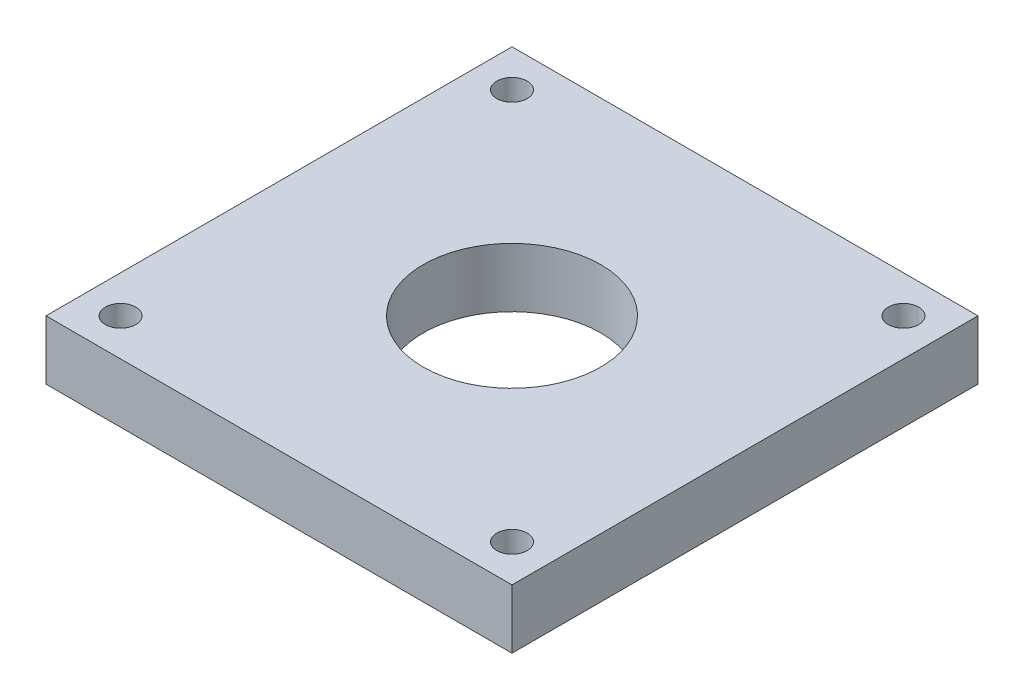
ISO-10303-21;
HEADER;
FILE_DESCRIPTION(('STEP AP214'),'2;1');
FILE_NAME('part.step','',(''),(''),'','','');
FILE_SCHEMA(('AUTOMOTIVE_DESIGN { 1 0 10303 214 1 1 1 1 }'));
ENDSEC;
DATA;
#1=APPLICATION_CONTEXT('core data for automotive mechanical design processes');
#2=APPLICATION_PROTOCOL_DEFINITION('international standard','automotive_design',2000,#1);
#3=PRODUCT_CONTEXT('',#1,'mechanical');
#4=PRODUCT('Part','Part','',(#3));
#5=PRODUCT_RELATED_PRODUCT_CATEGORY('part','',(#4));
#6=PRODUCT_DEFINITION_FORMATION('','',#4);
#7=PRODUCT_DEFINITION_CONTEXT('part definition',#1,'design');
#8=PRODUCT_DEFINITION('design','',#6,#7);
#9=PRODUCT_DEFINITION_SHAPE('','',#8);
#10=(LENGTH_UNIT() NAMED_UNIT(*) SI_UNIT(.MILLI.,.METRE.));
#11=(NAMED_UNIT(*) PLANE_ANGLE_UNIT() SI_UNIT($,.RADIAN.));
#12=(NAMED_UNIT(*) SI_UNIT($,.STERADIAN.) SOLID_ANGLE_UNIT());
#13=UNCERTAINTY_MEASURE_WITH_UNIT(LENGTH_MEASURE(1.E-05),#10,'distance_accuracy_value','');
#14=(GEOMETRIC_REPRESENTATION_CONTEXT(3) GLOBAL_UNCERTAINTY_ASSIGNED_CONTEXT((#13)) GLOBAL_UNIT_ASSIGNED_CONTEXT((#10,
#11,#12)) REPRESENTATION_CONTEXT('',''));
#15=CARTESIAN_POINT('',(0.,0.,0.));
#16=DIRECTION('',(0.,0.,1.));
#17=DIRECTION('',(1.,0.,0.));
#18=AXIS2_PLACEMENT_3D('',#15,#16,#17);
#19=CARTESIAN_POINT('',(0.,6.35,0.));
#20=DIRECTION('',(0.,1.,0.));
#21=DIRECTION('',(0.,0.,1.));
#22=AXIS2_PLACEMENT_3D('',#19,#20,#21);
#23=PLANE('',#22);
#24=CARTESIAN_POINT('',(-21.,6.35,21.));
#25=DIRECTION('',(0.,1.,0.));
#26=DIRECTION('',(0.,0.,1.));
#27=AXIS2_PLACEMENT_3D('',#24,#25,#26);
#28=CIRCLE('',#27,1.63194999999999);
#29=CARTESIAN_POINT('',(-21.,6.35,22.63195));
#30=VERTEX_POINT('',#29);
#31=EDGE_CURVE('E138',#30,#30,#28,.T.);
#32=ORIENTED_EDGE('',*,*,#31,.F.);
#33=EDGE_LOOP('',(#32));
#34=FACE_BOUND('',#33,.T.);
#35=CARTESIAN_POINT('',(21.,6.35,21.));
#36=DIRECTION('',(0.,1.,0.));
#37=DIRECTION('',(0.,0.,1.));
#38=AXIS2_PLACEMENT_3D('',#35,#36,#37);
#39=CIRCLE('',#38,1.63194999999999);
#40=CARTESIAN_POINT('',(21.,6.35,22.63195));
#41=VERTEX_POINT('',#40);
#42=EDGE_CURVE('E132',#41,#41,#39,.T.);
#43=ORIENTED_EDGE('',*,*,#42,.F.);
#44=EDGE_LOOP('',(#43));
#45=FACE_BOUND('',#44,.T.);
#46=CARTESIAN_POINT('',(21.,6.35,-21.));
#47=DIRECTION('',(0.,1.,0.));
#48=DIRECTION('',(0.,0.,1.));
#49=AXIS2_PLACEMENT_3D('',#46,#47,#48);
#50=CIRCLE('',#49,1.63194999999999);
#51=CARTESIAN_POINT('',(21.,6.35,-19.36805));
#52=VERTEX_POINT('',#51);
#53=EDGE_CURVE('E126',#52,#52,#50,.T.);
#54=ORIENTED_EDGE('',*,*,#53,.F.);
#55=EDGE_LOOP('',(#54));
#56=FACE_BOUND('',#55,.T.);
#57=CARTESIAN_POINT('',(-21.,6.35,-21.));
#58=DIRECTION('',(0.,1.,0.));
#59=DIRECTION('',(0.,0.,1.));
#60=AXIS2_PLACEMENT_3D('',#57,#58,#59);
#61=CIRCLE('',#60,1.63194999999999);
#62=CARTESIAN_POINT('',(-21.,6.35,-19.36805));
#63=VERTEX_POINT('',#62);
#64=EDGE_CURVE('E120',#63,#63,#61,.T.);
#65=ORIENTED_EDGE('',*,*,#64,.F.);
#66=EDGE_LOOP('',(#65));
#67=FACE_BOUND('',#66,.T.);
#68=DIRECTION('',(0.,0.,-1.));
#69=VECTOR('',#68,1.);
#70=CARTESIAN_POINT('',(25.,6.35,-25.));
#71=LINE('',#70,#69);
#72=CARTESIAN_POINT('',(25.,6.35,25.));
#73=VERTEX_POINT('',#72);
#74=CARTESIAN_POINT('',(25.,6.35,-25.));
#75=VERTEX_POINT('',#74);
#76=EDGE_CURVE('E85',#73,#75,#71,.T.);
#77=ORIENTED_EDGE('',*,*,#76,.T.);
#78=DIRECTION('',(-1.,0.,0.));
#79=VECTOR('',#78,1.);
#80=CARTESIAN_POINT('',(-25.,6.35,-25.));
#81=LINE('',#80,#79);
#82=CARTESIAN_POINT('',(-25.,6.35,-25.));
#83=VERTEX_POINT('',#82);
#84=EDGE_CURVE('E80',#75,#83,#81,.T.);
#85=ORIENTED_EDGE('',*,*,#84,.T.);
#86=DIRECTION('',(0.,0.,1.));
#87=VECTOR('',#86,1.);
#88=CARTESIAN_POINT('',(-25.,6.35,-25.));
#89=LINE('',#88,#87);
#90=CARTESIAN_POINT('',(-25.,6.35,25.));
#91=VERTEX_POINT('',#90);
#92=EDGE_CURVE('E83',#83,#91,#89,.T.);
#93=ORIENTED_EDGE('',*,*,#92,.T.);
#94=DIRECTION('',(1.,0.,0.));
#95=VECTOR('',#94,1.);
#96=CARTESIAN_POINT('',(-25.,6.35,25.));
#97=LINE('',#96,#95);
#98=EDGE_CURVE('E50',#91,#73,#97,.T.);
#99=ORIENTED_EDGE('',*,*,#98,.T.);
#100=EDGE_LOOP('',(#77,#85,#93,#99));
#101=FACE_BOUND('',#100,.T.);
#102=CARTESIAN_POINT('',(0.,6.35,0.));
#103=DIRECTION('',(0.,1.,0.));
#104=DIRECTION('',(0.,0.,1.));
#105=AXIS2_PLACEMENT_3D('',#102,#103,#104);
#106=CIRCLE('',#105,9.525);
#107=CARTESIAN_POINT('',(0.,6.35,9.525));
#108=VERTEX_POINT('',#107);
#109=EDGE_CURVE('E100',#108,#108,#106,.T.);
#110=ORIENTED_EDGE('',*,*,#109,.F.);
#111=EDGE_LOOP('',(#110));
#112=FACE_BOUND('',#111,.T.);
#113=ADVANCED_FACE('F33',(#34,#45,#56,#67,#101,#112),#23,.T.);
#114=CARTESIAN_POINT('',(0.,0.,0.));
#115=DIRECTION('',(0.,1.,0.));
#116=DIRECTION('',(0.,0.,1.));
#117=AXIS2_PLACEMENT_3D('',#114,#115,#116);
#118=PLANE('',#117);
#119=CARTESIAN_POINT('',(-21.,0.,21.));
#120=DIRECTION('',(0.,1.,0.));
#121=DIRECTION('',(0.,0.,1.));
#122=AXIS2_PLACEMENT_3D('',#119,#120,#121);
#123=CIRCLE('',#122,1.63195);
#124=CARTESIAN_POINT('',(-21.,0.,22.63195));
#125=VERTEX_POINT('',#124);
#126=EDGE_CURVE('E135',#125,#125,#123,.T.);
#127=ORIENTED_EDGE('',*,*,#126,.T.);
#128=EDGE_LOOP('',(#127));
#129=FACE_BOUND('',#128,.T.);
#130=CARTESIAN_POINT('',(21.,0.,21.));
#131=DIRECTION('',(0.,1.,0.));
#132=DIRECTION('',(0.,0.,1.));
#133=AXIS2_PLACEMENT_3D('',#130,#131,#132);
#134=CIRCLE('',#133,1.63195);
#135=CARTESIAN_POINT('',(21.,0.,22.63195));
#136=VERTEX_POINT('',#135);
#137=EDGE_CURVE('E129',#136,#136,#134,.T.);
#138=ORIENTED_EDGE('',*,*,#137,.T.);
#139=EDGE_LOOP('',(#138));
#140=FACE_BOUND('',#139,.T.);
#141=CARTESIAN_POINT('',(21.,0.,-21.));
#142=DIRECTION('',(0.,1.,0.));
#143=DIRECTION('',(0.,0.,1.));
#144=AXIS2_PLACEMENT_3D('',#141,#142,#143);
#145=CIRCLE('',#144,1.63195);
#146=CARTESIAN_POINT('',(21.,0.,-19.36805));
#147=VERTEX_POINT('',#146);
#148=EDGE_CURVE('E123',#147,#147,#145,.T.);
#149=ORIENTED_EDGE('',*,*,#148,.T.);
#150=EDGE_LOOP('',(#149));
#151=FACE_BOUND('',#150,.T.);
#152=CARTESIAN_POINT('',(-21.,0.,-21.));
#153=DIRECTION('',(0.,1.,0.));
#154=DIRECTION('',(0.,0.,1.));
#155=AXIS2_PLACEMENT_3D('',#152,#153,#154);
#156=CIRCLE('',#155,1.63195);
#157=CARTESIAN_POINT('',(-21.,0.,-19.36805));
#158=VERTEX_POINT('',#157);
#159=EDGE_CURVE('E115',#158,#158,#156,.T.);
#160=ORIENTED_EDGE('',*,*,#159,.T.);
#161=EDGE_LOOP('',(#160));
#162=FACE_BOUND('',#161,.T.);
#163=DIRECTION('',(0.,0.,-1.));
#164=VECTOR('',#163,1.);
#165=CARTESIAN_POINT('',(25.,0.,-25.));
#166=LINE('',#165,#164);
#167=CARTESIAN_POINT('',(25.,0.,25.));
#168=VERTEX_POINT('',#167);
#169=CARTESIAN_POINT('',(25.,0.,-25.));
#170=VERTEX_POINT('',#169);
#171=EDGE_CURVE('E97',#168,#170,#166,.T.);
#172=ORIENTED_EDGE('',*,*,#171,.F.);
#173=DIRECTION('',(1.,0.,0.));
#174=VECTOR('',#173,1.);
#175=CARTESIAN_POINT('',(-25.,0.,25.));
#176=LINE('',#175,#174);
#177=CARTESIAN_POINT('',(-25.,0.,25.));
#178=VERTEX_POINT('',#177);
#179=EDGE_CURVE('E73',#178,#168,#176,.T.);
#180=ORIENTED_EDGE('',*,*,#179,.F.);
#181=DIRECTION('',(0.,0.,1.));
#182=VECTOR('',#181,1.);
#183=CARTESIAN_POINT('',(-25.,0.,-25.));
#184=LINE('',#183,#182);
#185=CARTESIAN_POINT('',(-25.,0.,-25.));
#186=VERTEX_POINT('',#185);
#187=EDGE_CURVE('E67',#186,#178,#184,.T.);
#188=ORIENTED_EDGE('',*,*,#187,.F.);
#189=DIRECTION('',(-1.,0.,0.));
#190=VECTOR('',#189,1.);
#191=CARTESIAN_POINT('',(-25.,0.,-25.));
#192=LINE('',#191,#190);
#193=EDGE_CURVE('E89',#170,#186,#192,.T.);
#194=ORIENTED_EDGE('',*,*,#193,.F.);
#195=EDGE_LOOP('',(#172,#180,#188,#194));
#196=FACE_BOUND('',#195,.T.);
#197=CARTESIAN_POINT('',(0.,0.,0.));
#198=DIRECTION('',(0.,1.,0.));
#199=DIRECTION('',(0.,0.,1.));
#200=AXIS2_PLACEMENT_3D('',#197,#198,#199);
#201=CIRCLE('',#200,9.525);
#202=CARTESIAN_POINT('',(0.,0.,9.525));
#203=VERTEX_POINT('',#202);
#204=EDGE_CURVE('E112',#203,#203,#201,.T.);
#205=ORIENTED_EDGE('',*,*,#204,.T.);
#206=EDGE_LOOP('',(#205));
#207=FACE_BOUND('',#206,.T.);
#208=ADVANCED_FACE('F108',(#129,#140,#151,#162,#196,#207),#118,.F.);
#209=CARTESIAN_POINT('',(25.,6.35,-25.));
#210=DIRECTION('',(-1.,0.,0.));
#211=DIRECTION('',(0.,0.,1.));
#212=AXIS2_PLACEMENT_3D('',#209,#210,#211);
#213=PLANE('',#212);
#214=ORIENTED_EDGE('',*,*,#171,.T.);
#215=DIRECTION('',(0.,-1.,0.));
#216=VECTOR('',#215,1.);
#217=CARTESIAN_POINT('',(25.,6.35,-25.));
#218=LINE('',#217,#216);
#219=EDGE_CURVE('E11',#75,#170,#218,.T.);
#220=ORIENTED_EDGE('',*,*,#219,.F.);
#221=ORIENTED_EDGE('',*,*,#76,.F.);
#222=DIRECTION('',(0.,-1.,0.));
#223=VECTOR('',#222,1.);
#224=CARTESIAN_POINT('',(25.,6.35,25.));
#225=LINE('',#224,#223);
#226=EDGE_CURVE('E93',#73,#168,#225,.T.);
#227=ORIENTED_EDGE('',*,*,#226,.T.);
#228=EDGE_LOOP('',(#214,#220,#221,#227));
#229=FACE_BOUND('',#228,.T.);
#230=ADVANCED_FACE('F35',(#229),#213,.F.);
#231=CARTESIAN_POINT('',(-25.,6.35,-25.));
#232=DIRECTION('',(0.,0.,1.));
#233=DIRECTION('',(1.,0.,0.));
#234=AXIS2_PLACEMENT_3D('',#231,#232,#233);
#235=PLANE('',#234);
#236=ORIENTED_EDGE('',*,*,#193,.T.);
#237=DIRECTION('',(0.,-1.,0.));
#238=VECTOR('',#237,1.);
#239=CARTESIAN_POINT('',(-25.,6.35,-25.));
#240=LINE('',#239,#238);
#241=EDGE_CURVE('E42',#83,#186,#240,.T.);
#242=ORIENTED_EDGE('',*,*,#241,.F.);
#243=ORIENTED_EDGE('',*,*,#84,.F.);
#244=ORIENTED_EDGE('',*,*,#219,.T.);
#245=EDGE_LOOP('',(#236,#242,#243,#244));
#246=FACE_BOUND('',#245,.T.);
#247=ADVANCED_FACE('F88',(#246),#235,.F.);
#248=CARTESIAN_POINT('',(-25.,6.35,-25.));
#249=DIRECTION('',(1.,0.,0.));
#250=DIRECTION('',(0.,0.,-1.));
#251=AXIS2_PLACEMENT_3D('',#248,#249,#250);
#252=PLANE('',#251);
#253=ORIENTED_EDGE('',*,*,#187,.T.);
#254=DIRECTION('',(0.,-1.,0.));
#255=VECTOR('',#254,1.);
#256=CARTESIAN_POINT('',(-25.,6.35,25.));
#257=LINE('',#256,#255);
#258=EDGE_CURVE('E90',#91,#178,#257,.T.);
#259=ORIENTED_EDGE('',*,*,#258,.F.);
#260=ORIENTED_EDGE('',*,*,#92,.F.);
#261=ORIENTED_EDGE('',*,*,#241,.T.);
#262=EDGE_LOOP('',(#253,#259,#260,#261));
#263=FACE_BOUND('',#262,.T.);
#264=ADVANCED_FACE('F91',(#263),#252,.F.);
#265=CARTESIAN_POINT('',(-25.,6.35,25.));
#266=DIRECTION('',(0.,0.,-1.));
#267=DIRECTION('',(-1.,0.,0.));
#268=AXIS2_PLACEMENT_3D('',#265,#266,#267);
#269=PLANE('',#268);
#270=ORIENTED_EDGE('',*,*,#179,.T.);
#271=ORIENTED_EDGE('',*,*,#226,.F.);
#272=ORIENTED_EDGE('',*,*,#98,.F.);
#273=ORIENTED_EDGE('',*,*,#258,.T.);
#274=EDGE_LOOP('',(#270,#271,#272,#273));
#275=FACE_BOUND('',#274,.T.);
#276=ADVANCED_FACE('F105',(#275),#269,.F.);
#277=CARTESIAN_POINT('',(0.,6.35,0.));
#278=DIRECTION('',(0.,-1.,0.));
#279=DIRECTION('',(0.,0.,-1.));
#280=AXIS2_PLACEMENT_3D('',#277,#278,#279);
#281=CYLINDRICAL_SURFACE('',#280,9.525);
#282=ORIENTED_EDGE('',*,*,#109,.T.);
#283=EDGE_LOOP('',(#282));
#284=FACE_BOUND('',#283,.T.);
#285=ORIENTED_EDGE('',*,*,#204,.F.);
#286=EDGE_LOOP('',(#285));
#287=FACE_BOUND('',#286,.T.);
#288=ADVANCED_FACE('F156',(#284,#287),#281,.F.);
#289=CARTESIAN_POINT('',(-21.,6.35,-21.));
#290=DIRECTION('',(0.,1.,0.));
#291=DIRECTION('',(0.,0.,1.));
#292=AXIS2_PLACEMENT_3D('',#289,#290,#291);
#293=CYLINDRICAL_SURFACE('',#292,1.63194999999999);
#294=ORIENTED_EDGE('',*,*,#159,.F.);
#295=EDGE_LOOP('',(#294));
#296=FACE_BOUND('',#295,.T.);
#297=ORIENTED_EDGE('',*,*,#64,.T.);
#298=EDGE_LOOP('',(#297));
#299=FACE_BOUND('',#298,.T.);
#300=ADVANCED_FACE('F153',(#296,#299),#293,.F.);
#301=CARTESIAN_POINT('',(21.,6.35,-21.));
#302=DIRECTION('',(0.,1.,0.));
#303=DIRECTION('',(0.,0.,1.));
#304=AXIS2_PLACEMENT_3D('',#301,#302,#303);
#305=CYLINDRICAL_SURFACE('',#304,1.63194999999999);
#306=ORIENTED_EDGE('',*,*,#148,.F.);
#307=EDGE_LOOP('',(#306));
#308=FACE_BOUND('',#307,.T.);
#309=ORIENTED_EDGE('',*,*,#53,.T.);
#310=EDGE_LOOP('',(#309));
#311=FACE_BOUND('',#310,.T.);
#312=ADVANCED_FACE('F155',(#308,#311),#305,.F.);
#313=CARTESIAN_POINT('',(21.,6.35,21.));
#314=DIRECTION('',(0.,1.,0.));
#315=DIRECTION('',(0.,0.,1.));
#316=AXIS2_PLACEMENT_3D('',#313,#314,#315);
#317=CYLINDRICAL_SURFACE('',#316,1.63194999999999);
#318=ORIENTED_EDGE('',*,*,#137,.F.);
#319=EDGE_LOOP('',(#318));
#320=FACE_BOUND('',#319,.T.);
#321=ORIENTED_EDGE('',*,*,#42,.T.);
#322=EDGE_LOOP('',(#321));
#323=FACE_BOUND('',#322,.T.);
#324=ADVANCED_FACE('F163',(#320,#323),#317,.F.);
#325=CARTESIAN_POINT('',(-21.,6.35,21.));
#326=DIRECTION('',(0.,1.,0.));
#327=DIRECTION('',(0.,0.,1.));
#328=AXIS2_PLACEMENT_3D('',#325,#326,#327);
#329=CYLINDRICAL_SURFACE('',#328,1.63194999999999);
#330=ORIENTED_EDGE('',*,*,#126,.F.);
#331=EDGE_LOOP('',(#330));
#332=FACE_BOUND('',#331,.T.);
#333=ORIENTED_EDGE('',*,*,#31,.T.);
#334=EDGE_LOOP('',(#333));
#335=FACE_BOUND('',#334,.T.);
#336=ADVANCED_FACE('F142',(#332,#335),#329,.F.);
#337=CLOSED_SHELL('',(#113,#208,#230,#247,#264,#276,#288,#300,#312,#324,#336));
#338=MANIFOLD_SOLID_BREP('B2',#337);
#339=ADVANCED_BREP_SHAPE_REPRESENTATION('',(#18,#338),#14);
#340=SHAPE_DEFINITION_REPRESENTATION(#9,#339);
ENDSEC;
END-ISO-10303-21;
